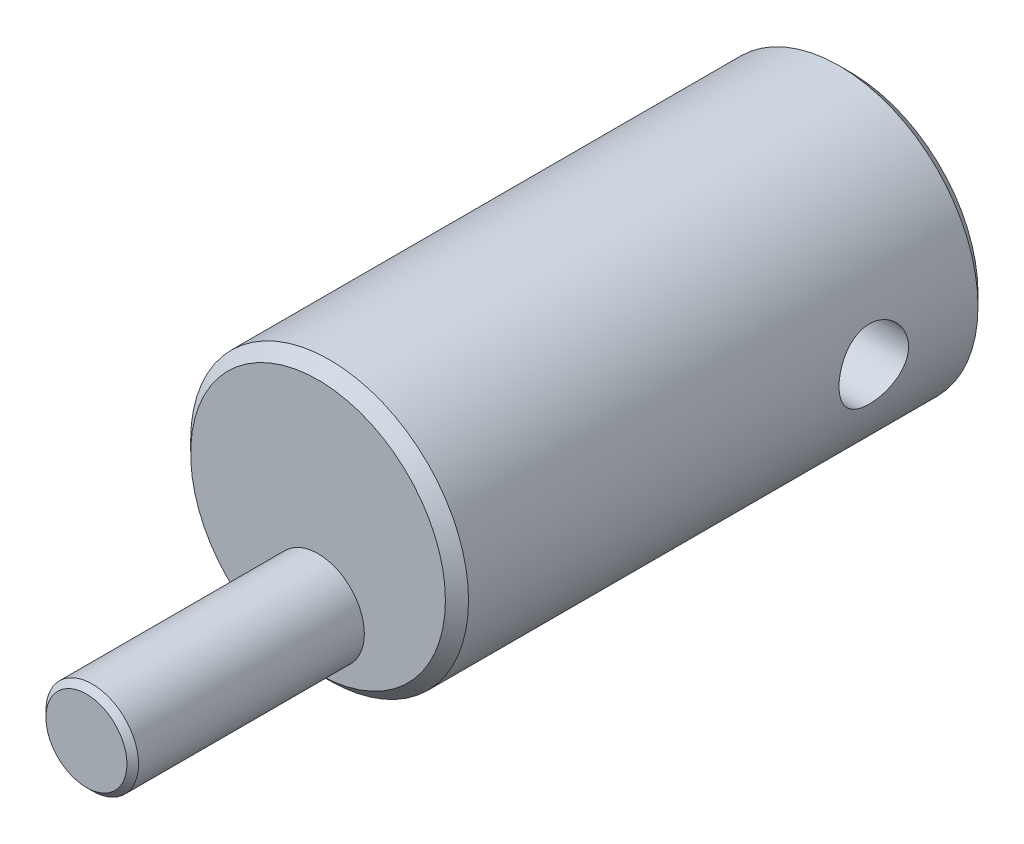
ISO-10303-21;
HEADER;
FILE_DESCRIPTION(('STEP AP214'),'2;1');
FILE_NAME('part.step','',(''),(''),'','','');
FILE_SCHEMA(('AUTOMOTIVE_DESIGN { 1 0 10303 214 1 1 1 1 }'));
ENDSEC;
DATA;
#1=APPLICATION_CONTEXT('core data for automotive mechanical design processes');
#2=APPLICATION_PROTOCOL_DEFINITION('international standard','automotive_design',2000,#1);
#3=PRODUCT_CONTEXT('',#1,'mechanical');
#4=PRODUCT('Part','Part','',(#3));
#5=PRODUCT_RELATED_PRODUCT_CATEGORY('part','',(#4));
#6=PRODUCT_DEFINITION_FORMATION('','',#4);
#7=PRODUCT_DEFINITION_CONTEXT('part definition',#1,'design');
#8=PRODUCT_DEFINITION('design','',#6,#7);
#9=PRODUCT_DEFINITION_SHAPE('','',#8);
#10=(LENGTH_UNIT() NAMED_UNIT(*) SI_UNIT(.MILLI.,.METRE.));
#11=(NAMED_UNIT(*) PLANE_ANGLE_UNIT() SI_UNIT($,.RADIAN.));
#12=(NAMED_UNIT(*) SI_UNIT($,.STERADIAN.) SOLID_ANGLE_UNIT());
#13=UNCERTAINTY_MEASURE_WITH_UNIT(LENGTH_MEASURE(1.E-05),#10,'distance_accuracy_value','');
#14=(GEOMETRIC_REPRESENTATION_CONTEXT(3) GLOBAL_UNCERTAINTY_ASSIGNED_CONTEXT((#13)) GLOBAL_UNIT_ASSIGNED_CONTEXT((#10,
#11,#12)) REPRESENTATION_CONTEXT('',''));
#15=CARTESIAN_POINT('',(0.,0.,0.));
#16=DIRECTION('',(0.,0.,1.));
#17=DIRECTION('',(1.,0.,0.));
#18=AXIS2_PLACEMENT_3D('',#15,#16,#17);
#19=CARTESIAN_POINT('',(0.,0.,23.));
#20=DIRECTION('',(0.,0.,-1.));
#21=DIRECTION('',(-1.,0.,0.));
#22=AXIS2_PLACEMENT_3D('',#19,#20,#21);
#23=CYLINDRICAL_SURFACE('',#22,6.);
#24=CARTESIAN_POINT('',(-6.,0.,3.5));
#25=CARTESIAN_POINT('',(-5.99999859868013,0.0828760886697311,3.50000232573816));
#26=CARTESIAN_POINT('',(-5.99826578131828,0.165778157830763,3.50689155077379));
#27=CARTESIAN_POINT('',(-5.99152113829892,0.329206323770533,3.534225151307));
#28=CARTESIAN_POINT('',(-5.98650745419968,0.409731046870739,3.55467720953785));
#29=CARTESIAN_POINT('',(-5.9737562633204,0.566020872182577,3.60843925346209));
#30=CARTESIAN_POINT('',(-5.96602202842087,0.641791563430003,3.64173379871528));
#31=CARTESIAN_POINT('',(-5.94865343807593,0.786672131904427,3.72018139004483));
#32=CARTESIAN_POINT('',(-5.9390190185405,0.855781784348759,3.76533483611894));
#33=CARTESIAN_POINT('',(-5.91867413591801,0.98680192730092,3.86720078965421));
#34=CARTESIAN_POINT('',(-5.90794707148533,1.04855569006107,3.92411157495918));
#35=CARTESIAN_POINT('',(-5.8867362011753,1.1617489272033,4.04745220490892));
#36=CARTESIAN_POINT('',(-5.87625242288348,1.21318723694913,4.1138831229465));
#37=CARTESIAN_POINT('',(-5.8565477569971,1.30502654279903,4.25559522673744));
#38=CARTESIAN_POINT('',(-5.84734794470605,1.34525221592536,4.3309932308104));
#39=CARTESIAN_POINT('',(-5.83149494812223,1.41239690855053,4.48774841165836));
#40=CARTESIAN_POINT('',(-5.82484135672789,1.43931805543933,4.56910463332576));
#41=CARTESIAN_POINT('',(-5.81500476717551,1.47855483680429,4.73374349820247));
#42=CARTESIAN_POINT('',(-5.81175491075426,1.49115226833334,4.8169548960498));
#43=CARTESIAN_POINT('',(-5.80889362537741,1.50226177506785,4.98436856901398));
#44=CARTESIAN_POINT('',(-5.80928160448644,1.50077614181798,5.06857068069861));
#45=CARTESIAN_POINT('',(-5.81359205496618,1.48398652463928,5.23341580774448));
#46=CARTESIAN_POINT('',(-5.81742863001879,1.46901834019052,5.3140956214651));
#47=CARTESIAN_POINT('',(-5.82806709676484,1.42622418690311,5.47176105091129));
#48=CARTESIAN_POINT('',(-5.83486919970696,1.39839730206942,5.54874640302898));
#49=CARTESIAN_POINT('',(-5.85075113904187,1.33038947793715,5.69773801625207));
#50=CARTESIAN_POINT('',(-5.85985327469421,1.29008666723291,5.76968617178955));
#51=CARTESIAN_POINT('',(-5.87929710846386,1.19835627601495,5.90591870975684));
#52=CARTESIAN_POINT('',(-5.88963902334735,1.14692674880884,5.97020174806726));
#53=CARTESIAN_POINT('',(-5.91075880539781,1.03266342468122,6.0912036156944));
#54=CARTESIAN_POINT('',(-5.92154069477971,0.96954625816586,6.14765449006135));
#55=CARTESIAN_POINT('',(-5.94205965578786,0.8346119175037,6.24922124246391));
#56=CARTESIAN_POINT('',(-5.95179669549415,0.762794477707944,6.29433677426357));
#57=CARTESIAN_POINT('',(-5.96917732094183,0.612115888681391,6.37205058622439));
#58=CARTESIAN_POINT('',(-5.97681360127725,0.533231393208623,6.40460534025443));
#59=CARTESIAN_POINT('',(-5.98907916991419,0.370876008142883,6.45591730570957));
#60=CARTESIAN_POINT('',(-5.99370903339281,0.287405999150485,6.47467715641814));
#61=CARTESIAN_POINT('',(-5.99935499271375,0.120539970390027,6.49745756555884));
#62=CARTESIAN_POINT('',(-6.00046053508279,0.0371967199882097,6.5018430260753));
#63=CARTESIAN_POINT('',(-5.99918804814451,-0.129032874801508,6.49675099794451));
#64=CARTESIAN_POINT('',(-5.99681033241847,-0.211919259644595,6.48727475720087));
#65=CARTESIAN_POINT('',(-5.98889581127357,-0.373614268776491,6.45502909160862));
#66=CARTESIAN_POINT('',(-5.98340634185811,-0.452465118968754,6.43245873652301));
#67=CARTESIAN_POINT('',(-5.96988706634134,-0.605257292452511,6.37489291597155));
#68=CARTESIAN_POINT('',(-5.96185700369892,-0.679198119032634,6.33989619568683));
#69=CARTESIAN_POINT('',(-5.9439330792631,-0.821523134429847,6.25776387112527));
#70=CARTESIAN_POINT('',(-5.93400867366932,-0.88978544183583,6.21042388760324));
#71=CARTESIAN_POINT('',(-5.91344509187419,-1.01752661364325,6.10521009120303));
#72=CARTESIAN_POINT('',(-5.90280579251705,-1.07700395897301,6.04733446038309));
#73=CARTESIAN_POINT('',(-5.88168956960771,-1.18699056807273,5.92099803915554));
#74=CARTESIAN_POINT('',(-5.87122304187281,-1.23724386762203,5.85231229699758));
#75=CARTESIAN_POINT('',(-5.85192878377239,-1.3255107590127,5.70726736553428));
#76=CARTESIAN_POINT('',(-5.84310098067026,-1.36352489415794,5.63090851704025));
#77=CARTESIAN_POINT('',(-5.82818094734665,-1.42595142060929,5.47309427758692));
#78=CARTESIAN_POINT('',(-5.82207255291906,-1.45044439665406,5.39167237165599));
#79=CARTESIAN_POINT('',(-5.81326744090184,-1.48534565995378,5.22569036211089));
#80=CARTESIAN_POINT('',(-5.81056997719936,-1.49575702747866,5.14113094896751));
#81=CARTESIAN_POINT('',(-5.80894901203957,-1.50203859033399,4.9738789761448));
#82=CARTESIAN_POINT('',(-5.80991932728264,-1.49831789778012,4.89120256487527));
#83=CARTESIAN_POINT('',(-5.81527909007843,-1.47737727831287,4.72769611133202));
#84=CARTESIAN_POINT('',(-5.81966846891857,-1.46015762268677,4.64686603198635));
#85=CARTESIAN_POINT('',(-5.83131260682722,-1.41293131944279,4.48979154093459));
#86=CARTESIAN_POINT('',(-5.83855015236309,-1.38300140468038,4.41352269475979));
#87=CARTESIAN_POINT('',(-5.85507755724829,-1.31126491360507,4.26703461728631));
#88=CARTESIAN_POINT('',(-5.86436770120773,-1.26945669003419,4.19681622681309));
#89=CARTESIAN_POINT('',(-5.88425634263512,-1.17386774863714,4.06244537099798));
#90=CARTESIAN_POINT('',(-5.89488264831757,-1.11980316291226,3.99849892657604));
#91=CARTESIAN_POINT('',(-5.91608027246286,-1.00178937118974,3.88045295520459));
#92=CARTESIAN_POINT('',(-5.9266515772706,-0.937837821261146,3.82635576988703));
#93=CARTESIAN_POINT('',(-5.94677655647663,-0.800467586702591,3.72858869143539));
#94=CARTESIAN_POINT('',(-5.95630833365868,-0.726898422316388,3.68512538632842));
#95=CARTESIAN_POINT('',(-5.97304924975118,-0.573266059510478,3.61125253705947));
#96=CARTESIAN_POINT('',(-5.98026005199781,-0.493207563436741,3.58083363935146));
#97=CARTESIAN_POINT('',(-5.99048059565542,-0.344410253243472,3.53842816967035));
#98=CARTESIAN_POINT('',(-5.99402585052691,-0.276380170908069,3.52404875694657));
#99=CARTESIAN_POINT('',(-5.99878605231948,-0.138906071536283,3.50483405637806));
#100=CARTESIAN_POINT('',(-6.00000117450894,-0.0694621612426162,3.4999980506947));
#101=CARTESIAN_POINT('',(-6.,0.,3.5));
#102=B_SPLINE_CURVE_WITH_KNOTS('',3,(#24,#25,#26,#27,#28,#29,#30,#31,#32,#33,#34,#35,#36,#37,
#38,#39,#40,#41,#42,#43,#44,#45,#46,#47,#48,#49,#50,#51,#52,#53,#54,#55,#56,#57,#58,#59,#60,#61,
#62,#63,#64,#65,#66,#67,#68,#69,#70,#71,#72,#73,#74,#75,#76,#77,#78,#79,#80,#81,#82,#83,#84,#85,
#86,#87,#88,#89,#90,#91,#92,#93,#94,#95,#96,#97,#98,#99,#100,#101),.UNSPECIFIED.,.T.,.F.,(4,2,2,
2,2,2,2,2,2,2,2,2,2,2,2,2,2,2,2,2,2,2,2,2,2,2,2,2,2,2,2,2,2,2,2,2,2,2,4),(0.,0.24837371247189,
0.4968882377639,0.745104902286106,0.993329940169328,1.24614435437139,1.49898729580062,
1.75558647545807,2.01214461169368,2.2635629509943,2.51494038112697,2.76022497007018,
3.00552703466038,3.25330527873879,3.50112690836163,3.75601500969019,4.01091089558247,
4.26668229009114,4.52240473688643,4.77158308949276,5.02073901112743,5.26620274514037,
5.51169127322291,5.76153587565352,6.01142363008019,6.26744509204476,6.52345518749508,
6.77792254614036,7.03233423252408,7.27943780398613,7.52653640956034,7.77216400559447,
8.01782568136901,8.2698957640991,8.52202569770418,8.77872185499588,9.0352336382135,
9.24342242942149,9.4515955604304),.UNSPECIFIED.);
#103=CARTESIAN_POINT('',(-6.,0.,3.5));
#104=VERTEX_POINT('',#103);
#105=EDGE_CURVE('E10',#104,#104,#102,.T.);
#106=ORIENTED_EDGE('',*,*,#105,.T.);
#107=EDGE_LOOP('',(#106));
#108=FACE_BOUND('',#107,.T.);
#109=CARTESIAN_POINT('',(6.,0.,3.5));
#110=CARTESIAN_POINT('',(5.99999859868012,-0.0828760886697312,3.50000232573816));
#111=CARTESIAN_POINT('',(5.99826578131828,-0.165778157830763,3.50689155077379));
#112=CARTESIAN_POINT('',(5.99152113829892,-0.329206323770533,3.534225151307));
#113=CARTESIAN_POINT('',(5.98650745419968,-0.40973104687074,3.55467720953785));
#114=CARTESIAN_POINT('',(5.9737562633204,-0.566020872182578,3.60843925346209));
#115=CARTESIAN_POINT('',(5.96602202842087,-0.641791563430004,3.64173379871528));
#116=CARTESIAN_POINT('',(5.94865343807593,-0.786672131904427,3.72018139004483));
#117=CARTESIAN_POINT('',(5.9390190185405,-0.85578178434876,3.76533483611894));
#118=CARTESIAN_POINT('',(5.91867413591801,-0.986801927300921,3.86720078965421));
#119=CARTESIAN_POINT('',(5.90794707148533,-1.04855569006107,3.92411157495918));
#120=CARTESIAN_POINT('',(5.8867362011753,-1.1617489272033,4.04745220490892));
#121=CARTESIAN_POINT('',(5.87625242288348,-1.21318723694914,4.1138831229465));
#122=CARTESIAN_POINT('',(5.8565477569971,-1.30502654279903,4.25559522673744));
#123=CARTESIAN_POINT('',(5.84734794470605,-1.34525221592536,4.3309932308104));
#124=CARTESIAN_POINT('',(5.83149494812223,-1.41239690855053,4.48774841165836));
#125=CARTESIAN_POINT('',(5.82484135672789,-1.43931805543933,4.56910463332576));
#126=CARTESIAN_POINT('',(5.81500476717551,-1.47855483680429,4.73374349820248));
#127=CARTESIAN_POINT('',(5.81175491075426,-1.49115226833334,4.8169548960498));
#128=CARTESIAN_POINT('',(5.80889362537741,-1.50226177506785,4.98436856901398));
#129=CARTESIAN_POINT('',(5.80928160448644,-1.50077614181798,5.06857068069861));
#130=CARTESIAN_POINT('',(5.81359205496618,-1.48398652463928,5.23341580774448));
#131=CARTESIAN_POINT('',(5.81742863001879,-1.46901834019052,5.3140956214651));
#132=CARTESIAN_POINT('',(5.82806709676484,-1.42622418690311,5.47176105091129));
#133=CARTESIAN_POINT('',(5.83486919970696,-1.39839730206942,5.54874640302898));
#134=CARTESIAN_POINT('',(5.85075113904187,-1.33038947793715,5.69773801625207));
#135=CARTESIAN_POINT('',(5.85985327469421,-1.29008666723291,5.76968617178955));
#136=CARTESIAN_POINT('',(5.87929710846386,-1.19835627601495,5.90591870975684));
#137=CARTESIAN_POINT('',(5.88963902334735,-1.14692674880884,5.97020174806726));
#138=CARTESIAN_POINT('',(5.91075880539781,-1.03266342468122,6.0912036156944));
#139=CARTESIAN_POINT('',(5.92154069477971,-0.96954625816586,6.14765449006135));
#140=CARTESIAN_POINT('',(5.94205965578786,-0.8346119175037,6.24922124246391));
#141=CARTESIAN_POINT('',(5.95179669549415,-0.762794477707943,6.29433677426357));
#142=CARTESIAN_POINT('',(5.96917732094183,-0.612115888681391,6.37205058622439));
#143=CARTESIAN_POINT('',(5.97681360127725,-0.533231393208624,6.40460534025443));
#144=CARTESIAN_POINT('',(5.98907916991419,-0.370876008142883,6.45591730570957));
#145=CARTESIAN_POINT('',(5.99370903339281,-0.287405999150485,6.47467715641814));
#146=CARTESIAN_POINT('',(5.99935499271375,-0.120539970390027,6.49745756555884));
#147=CARTESIAN_POINT('',(6.00046053508279,-0.0371967199882102,6.5018430260753));
#148=CARTESIAN_POINT('',(5.99918804814451,0.129032874801508,6.49675099794451));
#149=CARTESIAN_POINT('',(5.99681033241847,0.211919259644595,6.48727475720087));
#150=CARTESIAN_POINT('',(5.98889581127357,0.373614268776492,6.45502909160862));
#151=CARTESIAN_POINT('',(5.98340634185811,0.452465118968754,6.43245873652301));
#152=CARTESIAN_POINT('',(5.96988706634134,0.605257292452511,6.37489291597155));
#153=CARTESIAN_POINT('',(5.96185700369892,0.679198119032635,6.33989619568683));
#154=CARTESIAN_POINT('',(5.94393307926311,0.821523134429848,6.25776387112527));
#155=CARTESIAN_POINT('',(5.93400867366932,0.889785441835831,6.21042388760324));
#156=CARTESIAN_POINT('',(5.91344509187419,1.01752661364325,6.10521009120303));
#157=CARTESIAN_POINT('',(5.90280579251705,1.07700395897301,6.04733446038309));
#158=CARTESIAN_POINT('',(5.88168956960771,1.18699056807273,5.92099803915554));
#159=CARTESIAN_POINT('',(5.87122304187281,1.23724386762203,5.85231229699758));
#160=CARTESIAN_POINT('',(5.85192878377239,1.3255107590127,5.70726736553428));
#161=CARTESIAN_POINT('',(5.84310098067026,1.36352489415794,5.63090851704025));
#162=CARTESIAN_POINT('',(5.82818094734665,1.42595142060929,5.47309427758692));
#163=CARTESIAN_POINT('',(5.82207255291906,1.45044439665406,5.39167237165599));
#164=CARTESIAN_POINT('',(5.81326744090184,1.48534565995378,5.22569036211089));
#165=CARTESIAN_POINT('',(5.81056997719936,1.49575702747866,5.14113094896751));
#166=CARTESIAN_POINT('',(5.80894901203957,1.50203859033399,4.9738789761448));
#167=CARTESIAN_POINT('',(5.80991932728264,1.49831789778012,4.89120256487527));
#168=CARTESIAN_POINT('',(5.81527909007843,1.47737727831287,4.72769611133202));
#169=CARTESIAN_POINT('',(5.81966846891857,1.46015762268677,4.64686603198635));
#170=CARTESIAN_POINT('',(5.83131260682722,1.41293131944279,4.48979154093459));
#171=CARTESIAN_POINT('',(5.83855015236309,1.38300140468038,4.41352269475979));
#172=CARTESIAN_POINT('',(5.85507755724829,1.31126491360507,4.26703461728631));
#173=CARTESIAN_POINT('',(5.86436770120773,1.26945669003419,4.19681622681308));
#174=CARTESIAN_POINT('',(5.88425634263512,1.17386774863714,4.06244537099798));
#175=CARTESIAN_POINT('',(5.89488264831757,1.11980316291225,3.99849892657604));
#176=CARTESIAN_POINT('',(5.91608027246286,1.00178937118974,3.88045295520459));
#177=CARTESIAN_POINT('',(5.9266515772706,0.937837821261146,3.82635576988703));
#178=CARTESIAN_POINT('',(5.94677655647663,0.80046758670259,3.72858869143539));
#179=CARTESIAN_POINT('',(5.95630833365868,0.726898422316387,3.68512538632842));
#180=CARTESIAN_POINT('',(5.97304924975118,0.573266059510477,3.61125253705947));
#181=CARTESIAN_POINT('',(5.98026005199781,0.49320756343674,3.58083363935146));
#182=CARTESIAN_POINT('',(5.99048059565542,0.344410253243471,3.53842816967035));
#183=CARTESIAN_POINT('',(5.99402585052691,0.276380170908068,3.52404875694657));
#184=CARTESIAN_POINT('',(5.99878605231948,0.138906071536283,3.50483405637806));
#185=CARTESIAN_POINT('',(6.00000117450894,0.0694621612426163,3.4999980506947));
#186=CARTESIAN_POINT('',(6.,0.,3.5));
#187=B_SPLINE_CURVE_WITH_KNOTS('',3,(#109,#110,#111,#112,#113,#114,#115,#116,#117,#118,#119,
#120,#121,#122,#123,#124,#125,#126,#127,#128,#129,#130,#131,#132,#133,#134,#135,#136,#137,#138,
#139,#140,#141,#142,#143,#144,#145,#146,#147,#148,#149,#150,#151,#152,#153,#154,#155,#156,#157,
#158,#159,#160,#161,#162,#163,#164,#165,#166,#167,#168,#169,#170,#171,#172,#173,#174,#175,#176,
#177,#178,#179,#180,#181,#182,#183,#184,#185,#186),.UNSPECIFIED.,.T.,.F.,(4,2,2,2,2,2,2,2,2,2,2,
2,2,2,2,2,2,2,2,2,2,2,2,2,2,2,2,2,2,2,2,2,2,2,2,2,2,2,4),(0.,0.24837371247189,0.4968882377639,
0.745104902286106,0.993329940169329,1.24614435437139,1.49898729580062,1.75558647545807,
2.01214461169368,2.2635629509943,2.51494038112697,2.76022497007018,3.00552703466038,
3.25330527873879,3.50112690836163,3.75601500969019,4.01091089558247,4.26668229009114,
4.52240473688643,4.77158308949276,5.02073901112743,5.26620274514037,5.5116912732229,
5.76153587565352,6.01142363008019,6.26744509204476,6.52345518749508,6.77792254614036,
7.03233423252408,7.27943780398613,7.52653640956034,7.77216400559447,8.01782568136901,
8.2698957640991,8.52202569770418,8.77872185499588,9.0352336382135,9.24342242942149,
9.4515955604304),.UNSPECIFIED.);
#188=CARTESIAN_POINT('',(6.,0.,3.5));
#189=VERTEX_POINT('',#188);
#190=EDGE_CURVE('E53',#189,#189,#187,.T.);
#191=ORIENTED_EDGE('',*,*,#190,.T.);
#192=EDGE_LOOP('',(#191));
#193=FACE_BOUND('',#192,.T.);
#194=CARTESIAN_POINT('',(0.,0.,22.5));
#195=DIRECTION('',(0.,0.,1.));
#196=DIRECTION('',(1.,0.,0.));
#197=AXIS2_PLACEMENT_3D('',#194,#195,#196);
#198=CIRCLE('',#197,6.);
#199=CARTESIAN_POINT('',(6.,0.,22.5));
#200=VERTEX_POINT('',#199);
#201=EDGE_CURVE('E103',#200,#200,#198,.F.);
#202=ORIENTED_EDGE('',*,*,#201,.T.);
#203=EDGE_LOOP('',(#202));
#204=FACE_BOUND('',#203,.T.);
#205=CARTESIAN_POINT('',(0.,0.,0.5));
#206=DIRECTION('',(0.,0.,1.));
#207=DIRECTION('',(1.,0.,0.));
#208=AXIS2_PLACEMENT_3D('',#205,#206,#207);
#209=CIRCLE('',#208,6.);
#210=CARTESIAN_POINT('',(6.,0.,0.5));
#211=VERTEX_POINT('',#210);
#212=EDGE_CURVE('E106',#211,#211,#209,.T.);
#213=ORIENTED_EDGE('',*,*,#212,.T.);
#214=EDGE_LOOP('',(#213));
#215=FACE_BOUND('',#214,.T.);
#216=ADVANCED_FACE('F39',(#108,#193,#204,#215),#23,.T.);
#217=CARTESIAN_POINT('',(0.,0.,23.));
#218=DIRECTION('',(0.,0.,1.));
#219=DIRECTION('',(1.,0.,0.));
#220=AXIS2_PLACEMENT_3D('',#217,#218,#219);
#221=PLANE('',#220);
#222=CARTESIAN_POINT('',(0.,0.,23.));
#223=DIRECTION('',(0.,0.,1.));
#224=DIRECTION('',(1.,0.,0.));
#225=AXIS2_PLACEMENT_3D('',#222,#223,#224);
#226=CIRCLE('',#225,5.49999999999999);
#227=CARTESIAN_POINT('',(5.49999999999999,0.,23.));
#228=VERTEX_POINT('',#227);
#229=EDGE_CURVE('E109',#228,#228,#226,.T.);
#230=ORIENTED_EDGE('',*,*,#229,.T.);
#231=EDGE_LOOP('',(#230));
#232=FACE_BOUND('',#231,.T.);
#233=CARTESIAN_POINT('',(0.,-3.,23.));
#234=DIRECTION('',(0.,0.,1.));
#235=DIRECTION('',(1.,0.,0.));
#236=AXIS2_PLACEMENT_3D('',#233,#234,#235);
#237=CIRCLE('',#236,2.);
#238=CARTESIAN_POINT('',(2.,-3.,23.));
#239=VERTEX_POINT('',#238);
#240=EDGE_CURVE('E116',#239,#239,#237,.T.);
#241=ORIENTED_EDGE('',*,*,#240,.F.);
#242=EDGE_LOOP('',(#241));
#243=FACE_BOUND('',#242,.T.);
#244=ADVANCED_FACE('F88',(#232,#243),#221,.T.);
#245=CARTESIAN_POINT('',(0.,0.,0.));
#246=DIRECTION('',(0.,0.,1.));
#247=DIRECTION('',(1.,0.,0.));
#248=AXIS2_PLACEMENT_3D('',#245,#246,#247);
#249=PLANE('',#248);
#250=CARTESIAN_POINT('',(0.,0.,0.));
#251=DIRECTION('',(0.,0.,1.));
#252=DIRECTION('',(1.,0.,0.));
#253=AXIS2_PLACEMENT_3D('',#250,#251,#252);
#254=CIRCLE('',#253,5.5);
#255=CARTESIAN_POINT('',(5.5,0.,0.));
#256=VERTEX_POINT('',#255);
#257=EDGE_CURVE('E113',#256,#256,#254,.F.);
#258=ORIENTED_EDGE('',*,*,#257,.T.);
#259=EDGE_LOOP('',(#258));
#260=FACE_BOUND('',#259,.T.);
#261=ADVANCED_FACE('F86',(#260),#249,.F.);
#262=CARTESIAN_POINT('',(0.,-3.,33.));
#263=DIRECTION('',(0.,0.,-1.));
#264=DIRECTION('',(-1.,0.,0.));
#265=AXIS2_PLACEMENT_3D('',#262,#263,#264);
#266=CYLINDRICAL_SURFACE('',#265,2.);
#267=CARTESIAN_POINT('',(0.,-3.,32.75));
#268=DIRECTION('',(0.,0.,1.));
#269=DIRECTION('',(1.,0.,0.));
#270=AXIS2_PLACEMENT_3D('',#267,#268,#269);
#271=CIRCLE('',#270,2.);
#272=CARTESIAN_POINT('',(2.,-3.,32.75));
#273=VERTEX_POINT('',#272);
#274=EDGE_CURVE('E58',#273,#273,#271,.F.);
#275=ORIENTED_EDGE('',*,*,#274,.T.);
#276=EDGE_LOOP('',(#275));
#277=FACE_BOUND('',#276,.T.);
#278=ORIENTED_EDGE('',*,*,#240,.T.);
#279=EDGE_LOOP('',(#278));
#280=FACE_BOUND('',#279,.T.);
#281=ADVANCED_FACE('F82',(#277,#280),#266,.T.);
#282=CARTESIAN_POINT('',(0.,-3.,33.));
#283=DIRECTION('',(0.,0.,1.));
#284=DIRECTION('',(1.,0.,0.));
#285=AXIS2_PLACEMENT_3D('',#282,#283,#284);
#286=PLANE('',#285);
#287=CARTESIAN_POINT('',(0.,-3.,33.));
#288=DIRECTION('',(0.,0.,1.));
#289=DIRECTION('',(1.,0.,0.));
#290=AXIS2_PLACEMENT_3D('',#287,#288,#289);
#291=CIRCLE('',#290,1.75000000000001);
#292=CARTESIAN_POINT('',(1.75000000000001,-3.,33.));
#293=VERTEX_POINT('',#292);
#294=EDGE_CURVE('E63',#293,#293,#291,.T.);
#295=ORIENTED_EDGE('',*,*,#294,.T.);
#296=EDGE_LOOP('',(#295));
#297=FACE_BOUND('',#296,.T.);
#298=ADVANCED_FACE('F77',(#297),#286,.T.);
#299=CARTESIAN_POINT('',(0.,0.,23.));
#300=DIRECTION('',(0.,0.,-1.));
#301=DIRECTION('',(-1.,0.,0.));
#302=AXIS2_PLACEMENT_3D('',#299,#300,#301);
#303=CONICAL_SURFACE('',#302,5.49999999999999,0.785398163397447);
#304=ORIENTED_EDGE('',*,*,#201,.F.);
#305=EDGE_LOOP('',(#304));
#306=FACE_BOUND('',#305,.T.);
#307=ORIENTED_EDGE('',*,*,#229,.F.);
#308=EDGE_LOOP('',(#307));
#309=FACE_BOUND('',#308,.T.);
#310=ADVANCED_FACE('F81',(#306,#309),#303,.T.);
#311=CARTESIAN_POINT('',(0.,0.,0.5));
#312=DIRECTION('',(0.,0.,1.));
#313=DIRECTION('',(1.,0.,0.));
#314=AXIS2_PLACEMENT_3D('',#311,#312,#313);
#315=CONICAL_SURFACE('',#314,6.,0.785398163397454);
#316=ORIENTED_EDGE('',*,*,#257,.F.);
#317=EDGE_LOOP('',(#316));
#318=FACE_BOUND('',#317,.T.);
#319=ORIENTED_EDGE('',*,*,#212,.F.);
#320=EDGE_LOOP('',(#319));
#321=FACE_BOUND('',#320,.T.);
#322=ADVANCED_FACE('F126',(#318,#321),#315,.T.);
#323=CARTESIAN_POINT('',(0.,-3.,33.));
#324=DIRECTION('',(0.,0.,-1.));
#325=DIRECTION('',(-1.,0.,0.));
#326=AXIS2_PLACEMENT_3D('',#323,#324,#325);
#327=CONICAL_SURFACE('',#326,1.75000000000001,0.785398163397438);
#328=ORIENTED_EDGE('',*,*,#274,.F.);
#329=EDGE_LOOP('',(#328));
#330=FACE_BOUND('',#329,.T.);
#331=ORIENTED_EDGE('',*,*,#294,.F.);
#332=EDGE_LOOP('',(#331));
#333=FACE_BOUND('',#332,.T.);
#334=ADVANCED_FACE('F42',(#330,#333),#327,.T.);
#335=CARTESIAN_POINT('',(-6.,0.,5.));
#336=DIRECTION('',(1.,0.,0.));
#337=DIRECTION('',(0.,0.,-1.));
#338=AXIS2_PLACEMENT_3D('',#335,#336,#337);
#339=CYLINDRICAL_SURFACE('',#338,1.5);
#340=ORIENTED_EDGE('',*,*,#190,.F.);
#341=EDGE_LOOP('',(#340));
#342=FACE_BOUND('',#341,.T.);
#343=ORIENTED_EDGE('',*,*,#105,.F.);
#344=EDGE_LOOP('',(#343));
#345=FACE_BOUND('',#344,.T.);
#346=ADVANCED_FACE('F72',(#342,#345),#339,.F.);
#347=CLOSED_SHELL('',(#216,#244,#261,#281,#298,#310,#322,#334,#346));
#348=MANIFOLD_SOLID_BREP('B2',#347);
#349=ADVANCED_BREP_SHAPE_REPRESENTATION('',(#18,#348),#14);
#350=SHAPE_DEFINITION_REPRESENTATION(#9,#349);
ENDSEC;
END-ISO-10303-21;
